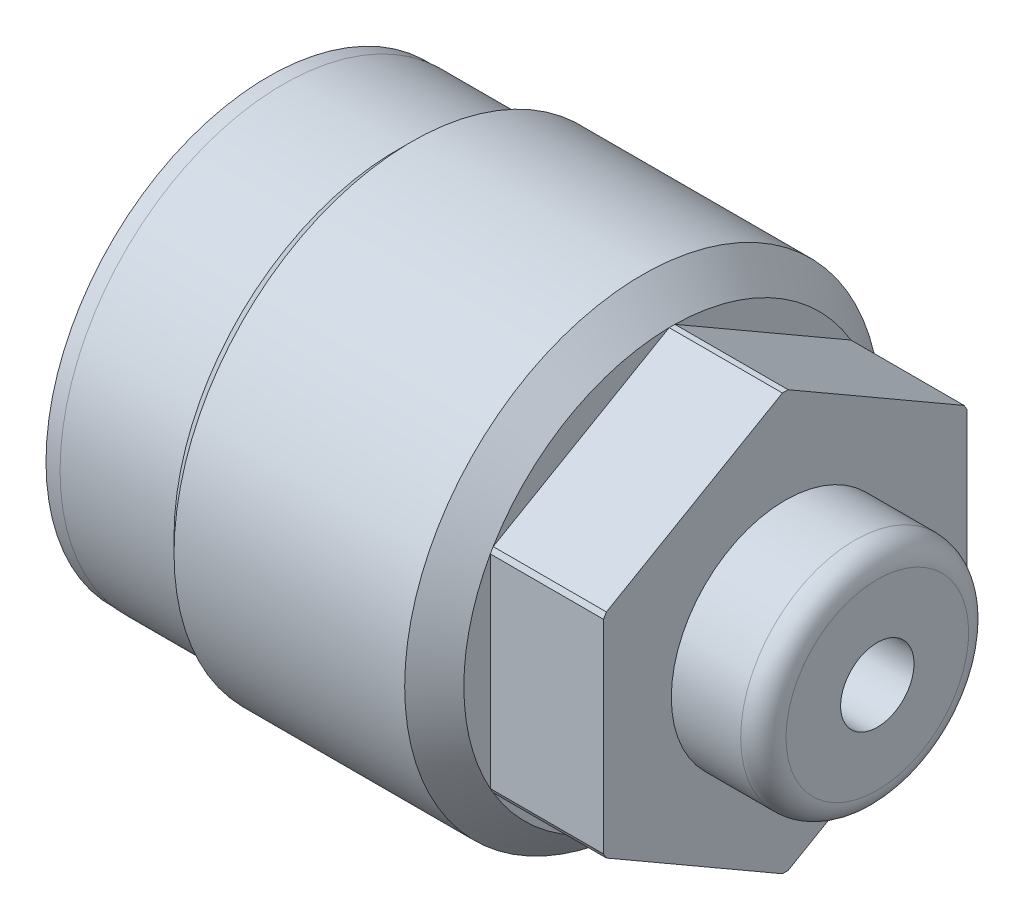
ISO-10303-21;
HEADER;
FILE_DESCRIPTION(('STEP AP214'),'2;1');
FILE_NAME('part.step','',(''),(''),'','','');
FILE_SCHEMA(('AUTOMOTIVE_DESIGN { 1 0 10303 214 1 1 1 1 }'));
ENDSEC;
DATA;
#1=APPLICATION_CONTEXT('core data for automotive mechanical design processes');
#2=APPLICATION_PROTOCOL_DEFINITION('international standard','automotive_design',2000,#1);
#3=PRODUCT_CONTEXT('',#1,'mechanical');
#4=PRODUCT('Part','Part','',(#3));
#5=PRODUCT_RELATED_PRODUCT_CATEGORY('part','',(#4));
#6=PRODUCT_DEFINITION_FORMATION('','',#4);
#7=PRODUCT_DEFINITION_CONTEXT('part definition',#1,'design');
#8=PRODUCT_DEFINITION('design','',#6,#7);
#9=PRODUCT_DEFINITION_SHAPE('','',#8);
#10=(LENGTH_UNIT() NAMED_UNIT(*) SI_UNIT(.MILLI.,.METRE.));
#11=(NAMED_UNIT(*) PLANE_ANGLE_UNIT() SI_UNIT($,.RADIAN.));
#12=(NAMED_UNIT(*) SI_UNIT($,.STERADIAN.) SOLID_ANGLE_UNIT());
#13=UNCERTAINTY_MEASURE_WITH_UNIT(LENGTH_MEASURE(1.E-05),#10,'distance_accuracy_value','');
#14=(GEOMETRIC_REPRESENTATION_CONTEXT(3) GLOBAL_UNCERTAINTY_ASSIGNED_CONTEXT((#13)) GLOBAL_UNIT_ASSIGNED_CONTEXT((#10,
#11,#12)) REPRESENTATION_CONTEXT('',''));
#15=CARTESIAN_POINT('',(0.,0.,0.));
#16=DIRECTION('',(0.,0.,1.));
#17=DIRECTION('',(1.,0.,0.));
#18=AXIS2_PLACEMENT_3D('',#15,#16,#17);
#19=CARTESIAN_POINT('',(41.3258,0.,0.));
#20=DIRECTION('',(-1.,0.,0.));
#21=DIRECTION('',(0.,-1.,0.));
#22=AXIS2_PLACEMENT_3D('',#19,#20,#21);
#23=PLANE('',#22);
#24=CARTESIAN_POINT('',(41.3258,0.,0.));
#25=DIRECTION('',(-1.,0.,0.));
#26=DIRECTION('',(0.,-1.,0.));
#27=AXIS2_PLACEMENT_3D('',#24,#25,#26);
#28=CIRCLE('',#27,6.35);
#29=CARTESIAN_POINT('',(41.3258,-6.35,0.));
#30=VERTEX_POINT('',#29);
#31=EDGE_CURVE('E12',#30,#30,#28,.F.);
#32=ORIENTED_EDGE('',*,*,#31,.T.);
#33=EDGE_LOOP('',(#32));
#34=FACE_BOUND('',#33,.T.);
#35=CARTESIAN_POINT('',(41.3258,0.,0.));
#36=DIRECTION('',(-1.,0.,0.));
#37=DIRECTION('',(0.,0.,1.));
#38=AXIS2_PLACEMENT_3D('',#35,#36,#37);
#39=CIRCLE('',#38,2.5527);
#40=CARTESIAN_POINT('',(41.3258,0.,2.5527));
#41=VERTEX_POINT('',#40);
#42=EDGE_CURVE('E141',#41,#41,#39,.T.);
#43=ORIENTED_EDGE('',*,*,#42,.T.);
#44=EDGE_LOOP('',(#43));
#45=FACE_BOUND('',#44,.T.);
#46=ADVANCED_FACE('F41',(#34,#45),#23,.F.);
#47=CARTESIAN_POINT('',(27.051,16.5354,0.));
#48=DIRECTION('',(1.,0.,0.));
#49=DIRECTION('',(0.,0.,-1.));
#50=AXIS2_PLACEMENT_3D('',#47,#48,#49);
#51=PLANE('',#50);
#52=DIRECTION('',(0.,-0.5,-0.866025403784439));
#53=VECTOR('',#52,1.);
#54=CARTESIAN_POINT('',(27.051,-7.2956866766147,12.6365));
#55=LINE('',#54,#53);
#56=CARTESIAN_POINT('',(27.051,-7.41042402479099,12.4377690834329));
#57=VERTEX_POINT('',#56);
#58=CARTESIAN_POINT('',(27.051,-14.4766360050531,0.198730916567052));
#59=VERTEX_POINT('',#58);
#60=EDGE_CURVE('E221',#57,#59,#55,.T.);
#61=ORIENTED_EDGE('',*,*,#60,.F.);
#62=CARTESIAN_POINT('',(27.051,0.,0.));
#63=DIRECTION('',(1.,0.,0.));
#64=DIRECTION('',(0.,0.,-1.));
#65=AXIS2_PLACEMENT_3D('',#62,#63,#64);
#66=CIRCLE('',#65,14.478);
#67=EDGE_CURVE('E250',#57,#59,#66,.T.);
#68=ORIENTED_EDGE('',*,*,#67,.T.);
#69=EDGE_LOOP('',(#61,#68));
#70=FACE_BOUND('',#69,.T.);
#71=ADVANCED_FACE('F269',(#70),#51,.T.);
#72=DIRECTION('',(0.,0.5,-0.866025403784439));
#73=VECTOR('',#72,1.);
#74=CARTESIAN_POINT('',(27.051,-14.5913733532294,0.));
#75=LINE('',#74,#73);
#76=CARTESIAN_POINT('',(27.051,-14.4766360050531,-0.198730916567062));
#77=VERTEX_POINT('',#76);
#78=CARTESIAN_POINT('',(27.051,-7.41042402479101,-12.4377690834329));
#79=VERTEX_POINT('',#78);
#80=EDGE_CURVE('E194',#77,#79,#75,.T.);
#81=ORIENTED_EDGE('',*,*,#80,.F.);
#82=CARTESIAN_POINT('',(27.051,0.,0.));
#83=DIRECTION('',(1.,0.,0.));
#84=DIRECTION('',(0.,0.,-1.));
#85=AXIS2_PLACEMENT_3D('',#82,#83,#84);
#86=CIRCLE('',#85,14.478);
#87=EDGE_CURVE('E55',#77,#79,#86,.T.);
#88=ORIENTED_EDGE('',*,*,#87,.T.);
#89=EDGE_LOOP('',(#81,#88));
#90=FACE_BOUND('',#89,.T.);
#91=ADVANCED_FACE('F275',(#90),#51,.T.);
#92=DIRECTION('',(0.,1.,0.));
#93=VECTOR('',#92,1.);
#94=CARTESIAN_POINT('',(27.051,-7.29568667661471,-12.6365));
#95=LINE('',#94,#93);
#96=CARTESIAN_POINT('',(27.051,-7.06621198026212,-12.6365));
#97=VERTEX_POINT('',#96);
#98=CARTESIAN_POINT('',(27.051,7.06621198026212,-12.6365));
#99=VERTEX_POINT('',#98);
#100=EDGE_CURVE('E189',#97,#99,#95,.T.);
#101=ORIENTED_EDGE('',*,*,#100,.F.);
#102=CARTESIAN_POINT('',(27.051,0.,0.));
#103=DIRECTION('',(1.,0.,0.));
#104=DIRECTION('',(0.,0.,-1.));
#105=AXIS2_PLACEMENT_3D('',#102,#103,#104);
#106=CIRCLE('',#105,14.478);
#107=EDGE_CURVE('E247',#97,#99,#106,.T.);
#108=ORIENTED_EDGE('',*,*,#107,.T.);
#109=EDGE_LOOP('',(#101,#108));
#110=FACE_BOUND('',#109,.T.);
#111=ADVANCED_FACE('F460',(#110),#51,.T.);
#112=DIRECTION('',(0.,0.5,0.866025403784439));
#113=VECTOR('',#112,1.);
#114=CARTESIAN_POINT('',(27.051,7.29568667661471,-12.6365));
#115=LINE('',#114,#113);
#116=CARTESIAN_POINT('',(27.051,7.410424024791,-12.4377690834329));
#117=VERTEX_POINT('',#116);
#118=CARTESIAN_POINT('',(27.051,14.4766360050531,-0.198730916567065));
#119=VERTEX_POINT('',#118);
#120=EDGE_CURVE('E212',#117,#119,#115,.T.);
#121=ORIENTED_EDGE('',*,*,#120,.F.);
#122=CARTESIAN_POINT('',(27.051,0.,0.));
#123=DIRECTION('',(1.,0.,0.));
#124=DIRECTION('',(0.,0.,-1.));
#125=AXIS2_PLACEMENT_3D('',#122,#123,#124);
#126=CIRCLE('',#125,14.478);
#127=EDGE_CURVE('E245',#117,#119,#126,.T.);
#128=ORIENTED_EDGE('',*,*,#127,.T.);
#129=EDGE_LOOP('',(#121,#128));
#130=FACE_BOUND('',#129,.T.);
#131=ADVANCED_FACE('F469',(#130),#51,.T.);
#132=DIRECTION('',(0.,-0.5,0.866025403784439));
#133=VECTOR('',#132,1.);
#134=CARTESIAN_POINT('',(27.051,14.5913733532294,0.));
#135=LINE('',#134,#133);
#136=CARTESIAN_POINT('',(27.051,14.4766360050531,0.198730916567052));
#137=VERTEX_POINT('',#136);
#138=CARTESIAN_POINT('',(27.051,7.410424024791,12.4377690834329));
#139=VERTEX_POINT('',#138);
#140=EDGE_CURVE('E215',#137,#139,#135,.T.);
#141=ORIENTED_EDGE('',*,*,#140,.F.);
#142=CARTESIAN_POINT('',(27.051,0.,0.));
#143=DIRECTION('',(1.,0.,0.));
#144=DIRECTION('',(0.,0.,-1.));
#145=AXIS2_PLACEMENT_3D('',#142,#143,#144);
#146=CIRCLE('',#145,14.478);
#147=EDGE_CURVE('E243',#137,#139,#146,.T.);
#148=ORIENTED_EDGE('',*,*,#147,.T.);
#149=EDGE_LOOP('',(#141,#148));
#150=FACE_BOUND('',#149,.T.);
#151=ADVANCED_FACE('F291',(#150),#51,.T.);
#152=CARTESIAN_POINT('',(34.925,21.8870600298441,-12.6365));
#153=DIRECTION('',(1.,0.,0.));
#154=DIRECTION('',(0.,0.,-1.));
#155=AXIS2_PLACEMENT_3D('',#152,#153,#154);
#156=PLANE('',#155);
#157=CARTESIAN_POINT('',(34.925,0.,0.));
#158=DIRECTION('',(-1.,0.,0.));
#159=DIRECTION('',(0.,-1.,0.));
#160=AXIS2_PLACEMENT_3D('',#157,#158,#159);
#161=CIRCLE('',#160,7.9248);
#162=CARTESIAN_POINT('',(34.925,-7.9248,0.));
#163=VERTEX_POINT('',#162);
#164=EDGE_CURVE('E186',#163,#163,#161,.T.);
#165=ORIENTED_EDGE('',*,*,#164,.T.);
#166=EDGE_LOOP('',(#165));
#167=FACE_BOUND('',#166,.T.);
#168=DIRECTION('',(0.,1.,0.));
#169=VECTOR('',#168,1.);
#170=CARTESIAN_POINT('',(34.925,-7.29568667661471,-12.6365));
#171=LINE('',#170,#169);
#172=CARTESIAN_POINT('',(34.925,-7.06621198026212,-12.6365));
#173=VERTEX_POINT('',#172);
#174=CARTESIAN_POINT('',(34.925,7.06621198026212,-12.6365));
#175=VERTEX_POINT('',#174);
#176=EDGE_CURVE('E190',#173,#175,#171,.T.);
#177=ORIENTED_EDGE('',*,*,#176,.T.);
#178=CARTESIAN_POINT('',(34.925,0.,0.));
#179=DIRECTION('',(1.,0.,0.));
#180=DIRECTION('',(0.,0.,-1.));
#181=AXIS2_PLACEMENT_3D('',#178,#179,#180);
#182=CIRCLE('',#181,14.478);
#183=CARTESIAN_POINT('',(34.925,7.410424024791,-12.4377690834329));
#184=VERTEX_POINT('',#183);
#185=EDGE_CURVE('E147',#175,#184,#182,.T.);
#186=ORIENTED_EDGE('',*,*,#185,.T.);
#187=DIRECTION('',(0.,0.5,0.866025403784439));
#188=VECTOR('',#187,1.);
#189=CARTESIAN_POINT('',(34.925,7.29568667661471,-12.6365));
#190=LINE('',#189,#188);
#191=CARTESIAN_POINT('',(34.925,14.4766360050531,-0.198730916567067));
#192=VERTEX_POINT('',#191);
#193=EDGE_CURVE('E193',#184,#192,#190,.T.);
#194=ORIENTED_EDGE('',*,*,#193,.T.);
#195=CARTESIAN_POINT('',(34.925,14.4766360050531,0.198730916567052));
#196=VERTEX_POINT('',#195);
#197=EDGE_CURVE('E151',#192,#196,#182,.T.);
#198=ORIENTED_EDGE('',*,*,#197,.T.);
#199=DIRECTION('',(0.,-0.5,0.866025403784439));
#200=VECTOR('',#199,1.);
#201=CARTESIAN_POINT('',(34.925,14.5913733532294,0.));
#202=LINE('',#201,#200);
#203=CARTESIAN_POINT('',(34.925,7.410424024791,12.4377690834329));
#204=VERTEX_POINT('',#203);
#205=EDGE_CURVE('E197',#196,#204,#202,.T.);
#206=ORIENTED_EDGE('',*,*,#205,.T.);
#207=CARTESIAN_POINT('',(34.925,7.06621198026213,12.6365));
#208=VERTEX_POINT('',#207);
#209=EDGE_CURVE('E599',#204,#208,#182,.T.);
#210=ORIENTED_EDGE('',*,*,#209,.T.);
#211=DIRECTION('',(0.,-1.,0.));
#212=VECTOR('',#211,1.);
#213=CARTESIAN_POINT('',(34.925,7.29568667661471,12.6365));
#214=LINE('',#213,#212);
#215=CARTESIAN_POINT('',(34.925,-7.06621198026213,12.6365));
#216=VERTEX_POINT('',#215);
#217=EDGE_CURVE('E200',#208,#216,#214,.T.);
#218=ORIENTED_EDGE('',*,*,#217,.T.);
#219=CARTESIAN_POINT('',(34.925,-7.410424024791,12.4377690834329));
#220=VERTEX_POINT('',#219);
#221=EDGE_CURVE('E597',#216,#220,#182,.T.);
#222=ORIENTED_EDGE('',*,*,#221,.T.);
#223=DIRECTION('',(0.,-0.5,-0.866025403784439));
#224=VECTOR('',#223,1.);
#225=CARTESIAN_POINT('',(34.925,-7.2956866766147,12.6365));
#226=LINE('',#225,#224);
#227=CARTESIAN_POINT('',(34.925,-14.4766360050531,0.198730916567065));
#228=VERTEX_POINT('',#227);
#229=EDGE_CURVE('E203',#220,#228,#226,.T.);
#230=ORIENTED_EDGE('',*,*,#229,.T.);
#231=CARTESIAN_POINT('',(34.925,-14.4766360050531,-0.198730916567062));
#232=VERTEX_POINT('',#231);
#233=EDGE_CURVE('E596',#228,#232,#182,.T.);
#234=ORIENTED_EDGE('',*,*,#233,.T.);
#235=DIRECTION('',(0.,0.5,-0.866025403784439));
#236=VECTOR('',#235,1.);
#237=CARTESIAN_POINT('',(34.925,-14.5913733532294,0.));
#238=LINE('',#237,#236);
#239=CARTESIAN_POINT('',(34.925,-7.41042402479101,-12.4377690834329));
#240=VERTEX_POINT('',#239);
#241=EDGE_CURVE('E206',#232,#240,#238,.T.);
#242=ORIENTED_EDGE('',*,*,#241,.T.);
#243=EDGE_CURVE('E144',#240,#173,#182,.T.);
#244=ORIENTED_EDGE('',*,*,#243,.T.);
#245=EDGE_LOOP('',(#177,#186,#194,#198,#206,#210,#218,#222,#230,#234,#242,#244));
#246=FACE_BOUND('',#245,.T.);
#247=ADVANCED_FACE('F287',(#167,#246),#156,.T.);
#248=CARTESIAN_POINT('',(34.925,-7.29568667661471,-12.6365));
#249=DIRECTION('',(0.,0.,1.));
#250=DIRECTION('',(1.,0.,0.));
#251=AXIS2_PLACEMENT_3D('',#248,#249,#250);
#252=PLANE('',#251);
#253=DIRECTION('',(1.,0.,0.));
#254=VECTOR('',#253,1.);
#255=CARTESIAN_POINT('',(-19.7181738785282,-7.06621198026212,-12.6365));
#256=LINE('',#255,#254);
#257=EDGE_CURVE('E63',#97,#173,#256,.T.);
#258=ORIENTED_EDGE('',*,*,#257,.F.);
#259=ORIENTED_EDGE('',*,*,#100,.T.);
#260=DIRECTION('',(1.,0.,0.));
#261=VECTOR('',#260,1.);
#262=CARTESIAN_POINT('',(-19.7181738785282,7.06621198026212,-12.6365));
#263=LINE('',#262,#261);
#264=EDGE_CURVE('E176',#175,#99,#263,.F.);
#265=ORIENTED_EDGE('',*,*,#264,.F.);
#266=ORIENTED_EDGE('',*,*,#176,.F.);
#267=EDGE_LOOP('',(#258,#259,#265,#266));
#268=FACE_BOUND('',#267,.T.);
#269=ADVANCED_FACE('F290',(#268),#252,.F.);
#270=CARTESIAN_POINT('',(34.925,7.29568667661471,-12.6365));
#271=DIRECTION('',(0.,-0.866025403784439,0.5));
#272=DIRECTION('',(0.,-0.5,-0.866025403784439));
#273=AXIS2_PLACEMENT_3D('',#270,#271,#272);
#274=PLANE('',#273);
#275=DIRECTION('',(1.,0.,0.));
#276=VECTOR('',#275,1.);
#277=CARTESIAN_POINT('',(-19.7181738785282,7.410424024791,-12.4377690834329));
#278=LINE('',#277,#276);
#279=EDGE_CURVE('E174',#117,#184,#278,.T.);
#280=ORIENTED_EDGE('',*,*,#279,.F.);
#281=ORIENTED_EDGE('',*,*,#120,.T.);
#282=DIRECTION('',(1.,0.,0.));
#283=VECTOR('',#282,1.);
#284=CARTESIAN_POINT('',(-19.7181738785282,14.4766360050531,-0.198730916567067));
#285=LINE('',#284,#283);
#286=EDGE_CURVE('E171',#192,#119,#285,.F.);
#287=ORIENTED_EDGE('',*,*,#286,.F.);
#288=ORIENTED_EDGE('',*,*,#193,.F.);
#289=EDGE_LOOP('',(#280,#281,#287,#288));
#290=FACE_BOUND('',#289,.T.);
#291=ADVANCED_FACE('F308',(#290),#274,.F.);
#292=CARTESIAN_POINT('',(34.925,14.5913733532294,0.));
#293=DIRECTION('',(0.,-0.866025403784439,-0.5));
#294=DIRECTION('',(0.,0.5,-0.866025403784439));
#295=AXIS2_PLACEMENT_3D('',#292,#293,#294);
#296=PLANE('',#295);
#297=DIRECTION('',(1.,0.,0.));
#298=VECTOR('',#297,1.);
#299=CARTESIAN_POINT('',(-19.7181738785282,14.4766360050531,0.198730916567052));
#300=LINE('',#299,#298);
#301=EDGE_CURVE('E169',#137,#196,#300,.T.);
#302=ORIENTED_EDGE('',*,*,#301,.F.);
#303=ORIENTED_EDGE('',*,*,#140,.T.);
#304=DIRECTION('',(1.,0.,0.));
#305=VECTOR('',#304,1.);
#306=CARTESIAN_POINT('',(-19.7181738785282,7.410424024791,12.4377690834329));
#307=LINE('',#306,#305);
#308=EDGE_CURVE('E166',#204,#139,#307,.F.);
#309=ORIENTED_EDGE('',*,*,#308,.F.);
#310=ORIENTED_EDGE('',*,*,#205,.F.);
#311=EDGE_LOOP('',(#302,#303,#309,#310));
#312=FACE_BOUND('',#311,.T.);
#313=ADVANCED_FACE('F304',(#312),#296,.F.);
#314=CARTESIAN_POINT('',(34.925,7.29568667661471,12.6365));
#315=DIRECTION('',(0.,0.,-1.));
#316=DIRECTION('',(0.,1.,0.));
#317=AXIS2_PLACEMENT_3D('',#314,#315,#316);
#318=PLANE('',#317);
#319=DIRECTION('',(1.,0.,0.));
#320=VECTOR('',#319,1.);
#321=CARTESIAN_POINT('',(-19.7181738785282,7.06621198026213,12.6365));
#322=LINE('',#321,#320);
#323=CARTESIAN_POINT('',(27.051,7.06621198026213,12.6365));
#324=VERTEX_POINT('',#323);
#325=EDGE_CURVE('E164',#324,#208,#322,.T.);
#326=ORIENTED_EDGE('',*,*,#325,.F.);
#327=DIRECTION('',(0.,-1.,0.));
#328=VECTOR('',#327,1.);
#329=CARTESIAN_POINT('',(27.051,7.29568667661471,12.6365));
#330=LINE('',#329,#328);
#331=CARTESIAN_POINT('',(27.051,-7.06621198026213,12.6365));
#332=VERTEX_POINT('',#331);
#333=EDGE_CURVE('E218',#324,#332,#330,.T.);
#334=ORIENTED_EDGE('',*,*,#333,.T.);
#335=DIRECTION('',(1.,0.,0.));
#336=VECTOR('',#335,1.);
#337=CARTESIAN_POINT('',(-19.7181738785282,-7.06621198026213,12.6365));
#338=LINE('',#337,#336);
#339=EDGE_CURVE('E161',#216,#332,#338,.F.);
#340=ORIENTED_EDGE('',*,*,#339,.F.);
#341=ORIENTED_EDGE('',*,*,#217,.F.);
#342=EDGE_LOOP('',(#326,#334,#340,#341));
#343=FACE_BOUND('',#342,.T.);
#344=ADVANCED_FACE('F300',(#343),#318,.F.);
#345=CARTESIAN_POINT('',(34.925,-7.2956866766147,12.6365));
#346=DIRECTION('',(0.,0.866025403784439,-0.5));
#347=DIRECTION('',(0.,0.5,0.866025403784439));
#348=AXIS2_PLACEMENT_3D('',#345,#346,#347);
#349=PLANE('',#348);
#350=DIRECTION('',(1.,0.,0.));
#351=VECTOR('',#350,1.);
#352=CARTESIAN_POINT('',(-19.7181738785282,-7.410424024791,12.4377690834329));
#353=LINE('',#352,#351);
#354=EDGE_CURVE('E159',#57,#220,#353,.T.);
#355=ORIENTED_EDGE('',*,*,#354,.F.);
#356=ORIENTED_EDGE('',*,*,#60,.T.);
#357=DIRECTION('',(1.,0.,0.));
#358=VECTOR('',#357,1.);
#359=CARTESIAN_POINT('',(-19.7181738785282,-14.4766360050531,0.198730916567065));
#360=LINE('',#359,#358);
#361=EDGE_CURVE('E155',#228,#59,#360,.F.);
#362=ORIENTED_EDGE('',*,*,#361,.F.);
#363=ORIENTED_EDGE('',*,*,#229,.F.);
#364=EDGE_LOOP('',(#355,#356,#362,#363));
#365=FACE_BOUND('',#364,.T.);
#366=ADVANCED_FACE('F296',(#365),#349,.F.);
#367=CARTESIAN_POINT('',(34.925,-14.5913733532294,0.));
#368=DIRECTION('',(0.,0.866025403784439,0.5));
#369=DIRECTION('',(0.,-0.5,0.866025403784439));
#370=AXIS2_PLACEMENT_3D('',#367,#368,#369);
#371=PLANE('',#370);
#372=DIRECTION('',(1.,0.,0.));
#373=VECTOR('',#372,1.);
#374=CARTESIAN_POINT('',(-19.7181738785282,-14.4766360050531,-0.198730916567062));
#375=LINE('',#374,#373);
#376=EDGE_CURVE('E236',#77,#232,#375,.T.);
#377=ORIENTED_EDGE('',*,*,#376,.F.);
#378=ORIENTED_EDGE('',*,*,#80,.T.);
#379=DIRECTION('',(1.,0.,0.));
#380=VECTOR('',#379,1.);
#381=CARTESIAN_POINT('',(-19.7181738785282,-7.41042402479101,-12.4377690834329));
#382=LINE('',#381,#380);
#383=EDGE_CURVE('E234',#240,#79,#382,.F.);
#384=ORIENTED_EDGE('',*,*,#383,.F.);
#385=ORIENTED_EDGE('',*,*,#241,.F.);
#386=EDGE_LOOP('',(#377,#378,#384,#385));
#387=FACE_BOUND('',#386,.T.);
#388=ADVANCED_FACE('F293',(#387),#371,.F.);
#389=ORIENTED_EDGE('',*,*,#333,.F.);
#390=CARTESIAN_POINT('',(27.051,0.,0.));
#391=DIRECTION('',(1.,0.,0.));
#392=DIRECTION('',(0.,0.,-1.));
#393=AXIS2_PLACEMENT_3D('',#390,#391,#392);
#394=CIRCLE('',#393,14.478);
#395=EDGE_CURVE('E241',#324,#332,#394,.T.);
#396=ORIENTED_EDGE('',*,*,#395,.T.);
#397=EDGE_LOOP('',(#389,#396));
#398=FACE_BOUND('',#397,.T.);
#399=ADVANCED_FACE('F278',(#398),#51,.T.);
#400=CARTESIAN_POINT('',(30.6025425410263,0.,0.));
#401=DIRECTION('',(-1.,0.,0.));
#402=DIRECTION('',(0.,0.,1.));
#403=AXIS2_PLACEMENT_3D('',#400,#401,#402);
#404=CYLINDRICAL_SURFACE('',#403,16.5354);
#405=CARTESIAN_POINT('',(24.9936,0.,0.));
#406=DIRECTION('',(1.,0.,0.));
#407=DIRECTION('',(0.,0.,-1.));
#408=AXIS2_PLACEMENT_3D('',#405,#406,#407);
#409=CIRCLE('',#408,16.5354);
#410=CARTESIAN_POINT('',(24.9936,0.,-16.5354));
#411=VERTEX_POINT('',#410);
#412=EDGE_CURVE('E238',#411,#411,#409,.F.);
#413=ORIENTED_EDGE('',*,*,#412,.T.);
#414=EDGE_LOOP('',(#413));
#415=FACE_BOUND('',#414,.T.);
#416=CARTESIAN_POINT('',(8.95349999999998,0.,0.));
#417=DIRECTION('',(-1.,0.,0.));
#418=DIRECTION('',(0.,0.,1.));
#419=AXIS2_PLACEMENT_3D('',#416,#417,#418);
#420=CIRCLE('',#419,16.5354);
#421=CARTESIAN_POINT('',(8.95349999999998,0.,16.5354));
#422=VERTEX_POINT('',#421);
#423=EDGE_CURVE('E209',#422,#422,#420,.T.);
#424=ORIENTED_EDGE('',*,*,#423,.F.);
#425=EDGE_LOOP('',(#424));
#426=FACE_BOUND('',#425,.T.);
#427=ADVANCED_FACE('F325',(#415,#426),#404,.T.);
#428=CARTESIAN_POINT('',(0.,0.,0.));
#429=DIRECTION('',(-1.,0.,0.));
#430=DIRECTION('',(0.,0.,1.));
#431=AXIS2_PLACEMENT_3D('',#428,#429,#430);
#432=PLANE('',#431);
#433=CARTESIAN_POINT('',(0.,0.,0.));
#434=DIRECTION('',(-1.,0.,0.));
#435=DIRECTION('',(0.,0.,1.));
#436=AXIS2_PLACEMENT_3D('',#433,#434,#435);
#437=CIRCLE('',#436,7.49300000000001);
#438=CARTESIAN_POINT('',(0.,0.,7.49300000000001));
#439=VERTEX_POINT('',#438);
#440=EDGE_CURVE('E180',#439,#439,#437,.T.);
#441=ORIENTED_EDGE('',*,*,#440,.F.);
#442=EDGE_LOOP('',(#441));
#443=FACE_BOUND('',#442,.T.);
#444=CARTESIAN_POINT('',(0.,0.,0.));
#445=DIRECTION('',(-1.,0.,0.));
#446=DIRECTION('',(0.,0.,1.));
#447=AXIS2_PLACEMENT_3D('',#444,#445,#446);
#448=CIRCLE('',#447,15.5067);
#449=CARTESIAN_POINT('',(0.,0.,15.5067));
#450=VERTEX_POINT('',#449);
#451=EDGE_CURVE('E231',#450,#450,#448,.T.);
#452=ORIENTED_EDGE('',*,*,#451,.T.);
#453=EDGE_LOOP('',(#452));
#454=FACE_BOUND('',#453,.T.);
#455=ADVANCED_FACE('F322',(#443,#454),#432,.T.);
#456=CARTESIAN_POINT('',(30.6025425410263,0.,0.));
#457=DIRECTION('',(-1.,0.,0.));
#458=DIRECTION('',(0.,0.,1.));
#459=AXIS2_PLACEMENT_3D('',#456,#457,#458);
#460=CYLINDRICAL_SURFACE('',#459,15.5067);
#461=CARTESIAN_POINT('',(7.92479999999999,0.,0.));
#462=DIRECTION('',(-1.,0.,0.));
#463=DIRECTION('',(0.,0.,1.));
#464=AXIS2_PLACEMENT_3D('',#461,#462,#463);
#465=CIRCLE('',#464,15.5067);
#466=CARTESIAN_POINT('',(7.92479999999999,0.,15.5067));
#467=VERTEX_POINT('',#466);
#468=EDGE_CURVE('E228',#467,#467,#465,.T.);
#469=ORIENTED_EDGE('',*,*,#468,.T.);
#470=EDGE_LOOP('',(#469));
#471=FACE_BOUND('',#470,.T.);
#472=ORIENTED_EDGE('',*,*,#451,.F.);
#473=EDGE_LOOP('',(#472));
#474=FACE_BOUND('',#473,.T.);
#475=ADVANCED_FACE('F318',(#471,#474),#460,.T.);
#476=CARTESIAN_POINT('',(7.92479999999999,0.,0.));
#477=DIRECTION('',(1.,0.,0.));
#478=DIRECTION('',(0.,0.,-1.));
#479=AXIS2_PLACEMENT_3D('',#476,#477,#478);
#480=CONICAL_SURFACE('',#479,15.5067,0.785398163397454);
#481=ORIENTED_EDGE('',*,*,#423,.T.);
#482=EDGE_LOOP('',(#481));
#483=FACE_BOUND('',#482,.T.);
#484=ORIENTED_EDGE('',*,*,#468,.F.);
#485=EDGE_LOOP('',(#484));
#486=FACE_BOUND('',#485,.T.);
#487=ADVANCED_FACE('F286',(#483,#486),#480,.T.);
#488=CARTESIAN_POINT('',(34.925,0.,0.));
#489=DIRECTION('',(-1.,0.,0.));
#490=DIRECTION('',(0.,-1.,0.));
#491=AXIS2_PLACEMENT_3D('',#488,#489,#490);
#492=CYLINDRICAL_SURFACE('',#491,7.9248);
#493=CARTESIAN_POINT('',(39.751,0.,0.));
#494=DIRECTION('',(-1.,0.,0.));
#495=DIRECTION('',(0.,-1.,0.));
#496=AXIS2_PLACEMENT_3D('',#493,#494,#495);
#497=CIRCLE('',#496,7.9248);
#498=CARTESIAN_POINT('',(39.751,-7.9248,0.));
#499=VERTEX_POINT('',#498);
#500=EDGE_CURVE('E49',#499,#499,#497,.T.);
#501=ORIENTED_EDGE('',*,*,#500,.T.);
#502=EDGE_LOOP('',(#501));
#503=FACE_BOUND('',#502,.T.);
#504=ORIENTED_EDGE('',*,*,#164,.F.);
#505=EDGE_LOOP('',(#504));
#506=FACE_BOUND('',#505,.T.);
#507=ADVANCED_FACE('F254',(#503,#506),#492,.T.);
#508=CARTESIAN_POINT('',(0.889,0.,0.));
#509=DIRECTION('',(1.,0.,0.));
#510=DIRECTION('',(0.,0.,-1.));
#511=AXIS2_PLACEMENT_3D('',#508,#509,#510);
#512=PLANE('',#511);
#513=CARTESIAN_POINT('',(0.889,0.,0.));
#514=DIRECTION('',(-1.,0.,0.));
#515=DIRECTION('',(0.,0.,1.));
#516=AXIS2_PLACEMENT_3D('',#513,#514,#515);
#517=CIRCLE('',#516,7.49300000000001);
#518=CARTESIAN_POINT('',(0.889,0.,7.49300000000001));
#519=VERTEX_POINT('',#518);
#520=EDGE_CURVE('E183',#519,#519,#517,.T.);
#521=ORIENTED_EDGE('',*,*,#520,.T.);
#522=EDGE_LOOP('',(#521));
#523=FACE_BOUND('',#522,.T.);
#524=ADVANCED_FACE('F282',(#523),#512,.F.);
#525=CARTESIAN_POINT('',(0.,0.,0.));
#526=DIRECTION('',(-1.,0.,0.));
#527=DIRECTION('',(0.,0.,1.));
#528=AXIS2_PLACEMENT_3D('',#525,#526,#527);
#529=CYLINDRICAL_SURFACE('',#528,7.49300000000001);
#530=ORIENTED_EDGE('',*,*,#520,.F.);
#531=EDGE_LOOP('',(#530));
#532=FACE_BOUND('',#531,.T.);
#533=ORIENTED_EDGE('',*,*,#440,.T.);
#534=EDGE_LOOP('',(#533));
#535=FACE_BOUND('',#534,.T.);
#536=ADVANCED_FACE('F369',(#532,#535),#529,.F.);
#537=CARTESIAN_POINT('',(-19.7181738785282,0.,0.));
#538=DIRECTION('',(1.,0.,0.));
#539=DIRECTION('',(0.,0.,-1.));
#540=AXIS2_PLACEMENT_3D('',#537,#538,#539);
#541=CYLINDRICAL_SURFACE('',#540,14.478);
#542=ORIENTED_EDGE('',*,*,#257,.T.);
#543=ORIENTED_EDGE('',*,*,#243,.F.);
#544=ORIENTED_EDGE('',*,*,#383,.T.);
#545=CARTESIAN_POINT('',(27.051,0.,0.));
#546=DIRECTION('',(1.,0.,0.));
#547=DIRECTION('',(0.,0.,-1.));
#548=AXIS2_PLACEMENT_3D('',#545,#546,#547);
#549=CIRCLE('',#548,14.478);
#550=EDGE_CURVE('E152',#97,#79,#549,.F.);
#551=ORIENTED_EDGE('',*,*,#550,.F.);
#552=EDGE_LOOP('',(#542,#543,#544,#551));
#553=FACE_BOUND('',#552,.T.);
#554=ADVANCED_FACE('F376',(#553),#541,.T.);
#555=ORIENTED_EDGE('',*,*,#361,.T.);
#556=EDGE_CURVE('E156',#77,#59,#549,.F.);
#557=ORIENTED_EDGE('',*,*,#556,.F.);
#558=ORIENTED_EDGE('',*,*,#376,.T.);
#559=ORIENTED_EDGE('',*,*,#233,.F.);
#560=EDGE_LOOP('',(#555,#557,#558,#559));
#561=FACE_BOUND('',#560,.T.);
#562=ADVANCED_FACE('F383',(#561),#541,.T.);
#563=ORIENTED_EDGE('',*,*,#339,.T.);
#564=EDGE_CURVE('E580',#57,#332,#549,.F.);
#565=ORIENTED_EDGE('',*,*,#564,.F.);
#566=ORIENTED_EDGE('',*,*,#354,.T.);
#567=ORIENTED_EDGE('',*,*,#221,.F.);
#568=EDGE_LOOP('',(#563,#565,#566,#567));
#569=FACE_BOUND('',#568,.T.);
#570=ADVANCED_FACE('F390',(#569),#541,.T.);
#571=ORIENTED_EDGE('',*,*,#308,.T.);
#572=EDGE_CURVE('E577',#324,#139,#549,.F.);
#573=ORIENTED_EDGE('',*,*,#572,.F.);
#574=ORIENTED_EDGE('',*,*,#325,.T.);
#575=ORIENTED_EDGE('',*,*,#209,.F.);
#576=EDGE_LOOP('',(#571,#573,#574,#575));
#577=FACE_BOUND('',#576,.T.);
#578=ADVANCED_FACE('F397',(#577),#541,.T.);
#579=ORIENTED_EDGE('',*,*,#286,.T.);
#580=EDGE_CURVE('E575',#137,#119,#549,.F.);
#581=ORIENTED_EDGE('',*,*,#580,.F.);
#582=ORIENTED_EDGE('',*,*,#301,.T.);
#583=ORIENTED_EDGE('',*,*,#197,.F.);
#584=EDGE_LOOP('',(#579,#581,#582,#583));
#585=FACE_BOUND('',#584,.T.);
#586=ADVANCED_FACE('F404',(#585),#541,.T.);
#587=ORIENTED_EDGE('',*,*,#264,.T.);
#588=EDGE_CURVE('E150',#117,#99,#549,.F.);
#589=ORIENTED_EDGE('',*,*,#588,.F.);
#590=ORIENTED_EDGE('',*,*,#279,.T.);
#591=ORIENTED_EDGE('',*,*,#185,.F.);
#592=EDGE_LOOP('',(#587,#589,#590,#591));
#593=FACE_BOUND('',#592,.T.);
#594=ADVANCED_FACE('F265',(#593),#541,.T.);
#595=CARTESIAN_POINT('',(24.9936,0.,0.));
#596=DIRECTION('',(-1.,0.,0.));
#597=DIRECTION('',(0.,0.,1.));
#598=AXIS2_PLACEMENT_3D('',#595,#596,#597);
#599=CONICAL_SURFACE('',#598,16.5354,0.785398163397452);
#600=ORIENTED_EDGE('',*,*,#67,.F.);
#601=ORIENTED_EDGE('',*,*,#564,.T.);
#602=ORIENTED_EDGE('',*,*,#395,.F.);
#603=ORIENTED_EDGE('',*,*,#572,.T.);
#604=ORIENTED_EDGE('',*,*,#147,.F.);
#605=ORIENTED_EDGE('',*,*,#580,.T.);
#606=ORIENTED_EDGE('',*,*,#127,.F.);
#607=ORIENTED_EDGE('',*,*,#588,.T.);
#608=ORIENTED_EDGE('',*,*,#107,.F.);
#609=ORIENTED_EDGE('',*,*,#550,.T.);
#610=ORIENTED_EDGE('',*,*,#87,.F.);
#611=ORIENTED_EDGE('',*,*,#556,.T.);
#612=EDGE_LOOP('',(#600,#601,#602,#603,#604,#605,#606,#607,#608,#609,#610,#611));
#613=FACE_BOUND('',#612,.T.);
#614=ORIENTED_EDGE('',*,*,#412,.F.);
#615=EDGE_LOOP('',(#614));
#616=FACE_BOUND('',#615,.T.);
#617=ADVANCED_FACE('F258',(#613,#616),#599,.T.);
#618=CARTESIAN_POINT('',(39.751,0.,0.));
#619=DIRECTION('',(-1.,0.,0.));
#620=DIRECTION('',(0.,-1.,0.));
#621=AXIS2_PLACEMENT_3D('',#618,#619,#620);
#622=TOROIDAL_SURFACE('',#621,6.35,1.5748);
#623=ORIENTED_EDGE('',*,*,#31,.F.);
#624=EDGE_LOOP('',(#623));
#625=FACE_BOUND('',#624,.T.);
#626=ORIENTED_EDGE('',*,*,#500,.F.);
#627=EDGE_LOOP('',(#626));
#628=FACE_BOUND('',#627,.T.);
#629=ADVANCED_FACE('F43',(#625,#628),#622,.T.);
#630=CARTESIAN_POINT('',(0.,0.,0.));
#631=DIRECTION('',(-1.,0.,0.));
#632=DIRECTION('',(0.,0.,1.));
#633=AXIS2_PLACEMENT_3D('',#630,#631,#632);
#634=CYLINDRICAL_SURFACE('',#633,2.5527);
#635=CARTESIAN_POINT('',(23.8096169021917,0.,0.));
#636=DIRECTION('',(-1.,0.,0.));
#637=DIRECTION('',(0.,0.,1.));
#638=AXIS2_PLACEMENT_3D('',#635,#636,#637);
#639=CIRCLE('',#638,2.5527);
#640=CARTESIAN_POINT('',(23.8096169021917,0.,2.5527));
#641=VERTEX_POINT('',#640);
#642=EDGE_CURVE('E139',#641,#641,#639,.T.);
#643=ORIENTED_EDGE('',*,*,#642,.T.);
#644=EDGE_LOOP('',(#643));
#645=FACE_BOUND('',#644,.T.);
#646=ORIENTED_EDGE('',*,*,#42,.F.);
#647=EDGE_LOOP('',(#646));
#648=FACE_BOUND('',#647,.T.);
#649=ADVANCED_FACE('F135',(#645,#648),#634,.F.);
#650=CARTESIAN_POINT('',(23.8096169021917,0.,0.));
#651=DIRECTION('',(1.,0.,0.));
#652=DIRECTION('',(0.,0.,-1.));
#653=AXIS2_PLACEMENT_3D('',#650,#651,#652);
#654=CONICAL_SURFACE('',#653,2.5527,1.02974425867665);
#655=CARTESIAN_POINT('',(22.2758,0.,0.));
#656=VERTEX_POINT('',#655);
#657=VERTEX_LOOP('',#656);
#658=FACE_BOUND('',#657,.T.);
#659=ORIENTED_EDGE('',*,*,#642,.F.);
#660=EDGE_LOOP('',(#659));
#661=FACE_BOUND('',#660,.T.);
#662=ADVANCED_FACE('F132',(#658,#661),#654,.F.);
#663=CLOSED_SHELL('',(#46,#71,#91,#111,#131,#151,#247,#269,#291,#313,#344,#366,#388,#399,#427,
#455,#475,#487,#507,#524,#536,#554,#562,#570,#578,#586,#594,#617,#629,#649,#662));
#664=MANIFOLD_SOLID_BREP('B2',#663);
#665=CARTESIAN_POINT('',(-0.025400000000006,12.7508,0.));
#666=DIRECTION('',(1.,0.,0.));
#667=DIRECTION('',(0.,0.,-1.));
#668=AXIS2_PLACEMENT_3D('',#665,#666,#667);
#669=PLANE('',#668);
#670=CARTESIAN_POINT('',(-0.0254000000000066,0.,0.));
#671=DIRECTION('',(1.,0.,0.));
#672=DIRECTION('',(0.,0.,-1.));
#673=AXIS2_PLACEMENT_3D('',#670,#671,#672);
#674=CIRCLE('',#673,15.4686);
#675=CARTESIAN_POINT('',(-0.0254000000000066,0.,-15.4686));
#676=VERTEX_POINT('',#675);
#677=EDGE_CURVE('E40',#676,#676,#674,.T.);
#678=ORIENTED_EDGE('',*,*,#677,.T.);
#679=EDGE_LOOP('',(#678));
#680=FACE_BOUND('',#679,.T.);
#681=CARTESIAN_POINT('',(-0.0254000000000054,0.,0.));
#682=DIRECTION('',(1.,0.,0.));
#683=DIRECTION('',(0.,0.,-1.));
#684=AXIS2_PLACEMENT_3D('',#681,#682,#683);
#685=CIRCLE('',#684,12.7508);
#686=CARTESIAN_POINT('',(-0.0254000000000054,0.,-12.7508));
#687=VERTEX_POINT('',#686);
#688=EDGE_CURVE('E638',#687,#687,#685,.T.);
#689=ORIENTED_EDGE('',*,*,#688,.F.);
#690=EDGE_LOOP('',(#689));
#691=FACE_BOUND('',#690,.T.);
#692=ADVANCED_FACE('F624',(#680,#691),#669,.T.);
#693=CARTESIAN_POINT('',(-0.762,0.,0.));
#694=DIRECTION('',(1.,0.,0.));
#695=DIRECTION('',(0.,0.,-1.));
#696=AXIS2_PLACEMENT_3D('',#693,#694,#695);
#697=CYLINDRICAL_SURFACE('',#696,15.4686);
#698=CARTESIAN_POINT('',(-1.01600000000001,0.,0.));
#699=DIRECTION('',(1.,0.,0.));
#700=DIRECTION('',(0.,0.,-1.));
#701=AXIS2_PLACEMENT_3D('',#698,#699,#700);
#702=CIRCLE('',#701,15.4686);
#703=CARTESIAN_POINT('',(-1.01600000000001,0.,-15.4686));
#704=VERTEX_POINT('',#703);
#705=EDGE_CURVE('E630',#704,#704,#702,.T.);
#706=ORIENTED_EDGE('',*,*,#705,.T.);
#707=EDGE_LOOP('',(#706));
#708=FACE_BOUND('',#707,.T.);
#709=ORIENTED_EDGE('',*,*,#677,.F.);
#710=EDGE_LOOP('',(#709));
#711=FACE_BOUND('',#710,.T.);
#712=ADVANCED_FACE('F648',(#708,#711),#697,.T.);
#713=CARTESIAN_POINT('',(-1.01600000000001,15.4686,0.));
#714=DIRECTION('',(-1.,0.,0.));
#715=DIRECTION('',(0.,0.,1.));
#716=AXIS2_PLACEMENT_3D('',#713,#714,#715);
#717=PLANE('',#716);
#718=CARTESIAN_POINT('',(-1.01600000000001,0.,0.));
#719=DIRECTION('',(1.,0.,0.));
#720=DIRECTION('',(0.,0.,-1.));
#721=AXIS2_PLACEMENT_3D('',#718,#719,#720);
#722=CIRCLE('',#721,12.7508);
#723=CARTESIAN_POINT('',(-1.01600000000001,0.,-12.7508));
#724=VERTEX_POINT('',#723);
#725=EDGE_CURVE('E634',#724,#724,#722,.T.);
#726=ORIENTED_EDGE('',*,*,#725,.T.);
#727=EDGE_LOOP('',(#726));
#728=FACE_BOUND('',#727,.T.);
#729=ORIENTED_EDGE('',*,*,#705,.F.);
#730=EDGE_LOOP('',(#729));
#731=FACE_BOUND('',#730,.T.);
#732=ADVANCED_FACE('F652',(#728,#731),#717,.T.);
#733=CARTESIAN_POINT('',(-0.762,0.,0.));
#734=DIRECTION('',(1.,0.,0.));
#735=DIRECTION('',(0.,0.,-1.));
#736=AXIS2_PLACEMENT_3D('',#733,#734,#735);
#737=CYLINDRICAL_SURFACE('',#736,12.7508);
#738=ORIENTED_EDGE('',*,*,#688,.T.);
#739=EDGE_LOOP('',(#738));
#740=FACE_BOUND('',#739,.T.);
#741=ORIENTED_EDGE('',*,*,#725,.F.);
#742=EDGE_LOOP('',(#741));
#743=FACE_BOUND('',#742,.T.);
#744=ADVANCED_FACE('F644',(#740,#743),#737,.F.);
#745=CLOSED_SHELL('',(#692,#712,#732,#744));
#746=MANIFOLD_SOLID_BREP('B6',#745);
#747=ADVANCED_BREP_SHAPE_REPRESENTATION('',(#18,#664,#746),#14);
#748=SHAPE_DEFINITION_REPRESENTATION(#9,#747);
ENDSEC;
END-ISO-10303-21;
